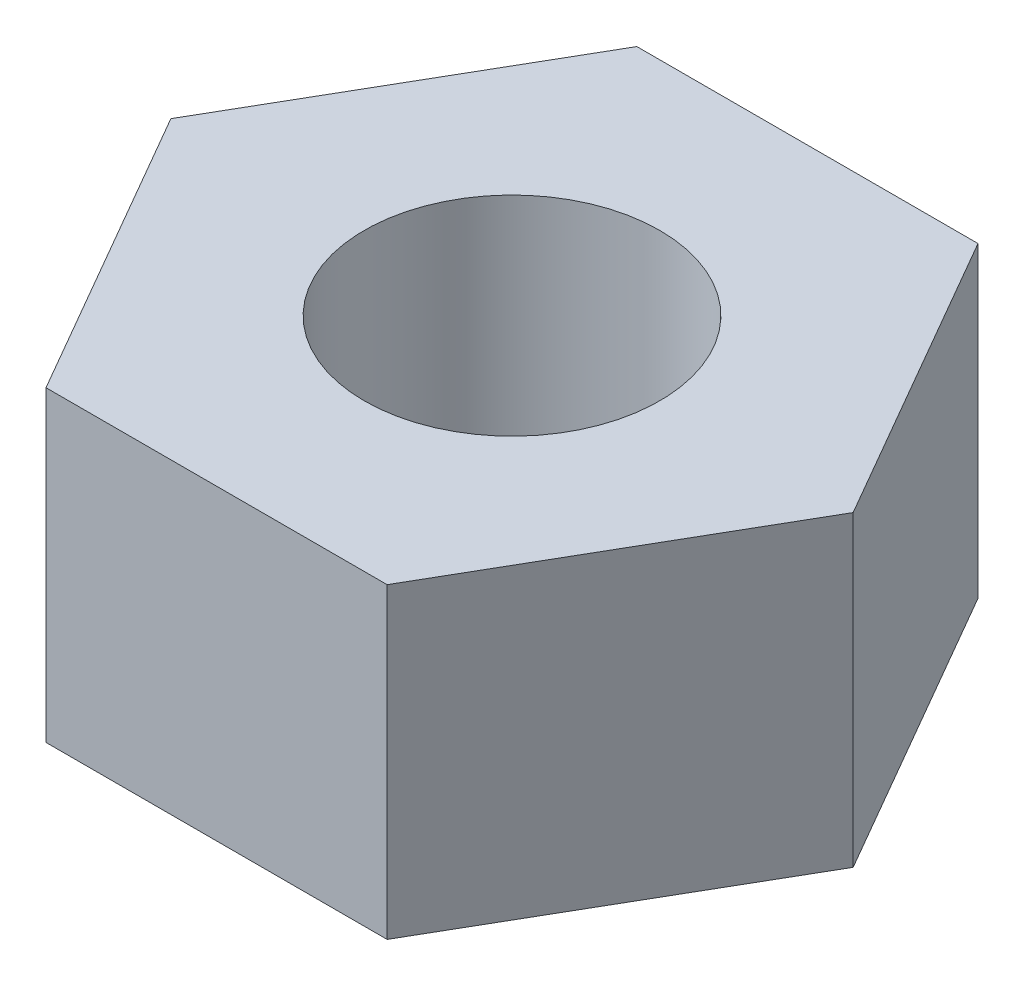
ISO-10303-21;
HEADER;
FILE_DESCRIPTION(('STEP AP214'),'2;1');
FILE_NAME('part.step','',(''),(''),'','','');
FILE_SCHEMA(('AUTOMOTIVE_DESIGN { 1 0 10303 214 1 1 1 1 }'));
ENDSEC;
DATA;
#1=APPLICATION_CONTEXT('core data for automotive mechanical design processes');
#2=APPLICATION_PROTOCOL_DEFINITION('international standard','automotive_design',2000,#1);
#3=PRODUCT_CONTEXT('',#1,'mechanical');
#4=PRODUCT('Part','Part','',(#3));
#5=PRODUCT_RELATED_PRODUCT_CATEGORY('part','',(#4));
#6=PRODUCT_DEFINITION_FORMATION('','',#4);
#7=PRODUCT_DEFINITION_CONTEXT('part definition',#1,'design');
#8=PRODUCT_DEFINITION('design','',#6,#7);
#9=PRODUCT_DEFINITION_SHAPE('','',#8);
#10=(LENGTH_UNIT() NAMED_UNIT(*) SI_UNIT(.MILLI.,.METRE.));
#11=(NAMED_UNIT(*) PLANE_ANGLE_UNIT() SI_UNIT($,.RADIAN.));
#12=(NAMED_UNIT(*) SI_UNIT($,.STERADIAN.) SOLID_ANGLE_UNIT());
#13=UNCERTAINTY_MEASURE_WITH_UNIT(LENGTH_MEASURE(1.E-05),#10,'distance_accuracy_value','');
#14=(GEOMETRIC_REPRESENTATION_CONTEXT(3) GLOBAL_UNCERTAINTY_ASSIGNED_CONTEXT((#13)) GLOBAL_UNIT_ASSIGNED_CONTEXT((#10,
#11,#12)) REPRESENTATION_CONTEXT('',''));
#15=CARTESIAN_POINT('',(0.,0.,0.));
#16=DIRECTION('',(0.,0.,1.));
#17=DIRECTION('',(1.,0.,0.));
#18=AXIS2_PLACEMENT_3D('',#15,#16,#17);
#19=CARTESIAN_POINT('',(0.,5.2,0.));
#20=DIRECTION('',(0.,-1.,0.));
#21=DIRECTION('',(0.,0.,-1.));
#22=AXIS2_PLACEMENT_3D('',#19,#20,#21);
#23=PLANE('',#22);
#24=DIRECTION('',(-1.,0.,0.));
#25=VECTOR('',#24,1.);
#26=CARTESIAN_POINT('',(-2.88675134594813,5.2,-5.));
#27=LINE('',#26,#25);
#28=CARTESIAN_POINT('',(2.88675134594813,5.2,-5.));
#29=VERTEX_POINT('',#28);
#30=CARTESIAN_POINT('',(-2.88675134594813,5.2,-5.));
#31=VERTEX_POINT('',#30);
#32=EDGE_CURVE('E135',#29,#31,#27,.T.);
#33=ORIENTED_EDGE('',*,*,#32,.T.);
#34=DIRECTION('',(-0.500000000000001,0.,0.866025403784438));
#35=VECTOR('',#34,1.);
#36=CARTESIAN_POINT('',(-2.88675134594813,5.2,-5.));
#37=LINE('',#36,#35);
#38=CARTESIAN_POINT('',(-5.77350269189627,5.2,0.));
#39=VERTEX_POINT('',#38);
#40=EDGE_CURVE('E93',#31,#39,#37,.T.);
#41=ORIENTED_EDGE('',*,*,#40,.T.);
#42=DIRECTION('',(0.500000000000001,0.,0.866025403784438));
#43=VECTOR('',#42,1.);
#44=CARTESIAN_POINT('',(-5.77350269189627,5.2,0.));
#45=LINE('',#44,#43);
#46=CARTESIAN_POINT('',(-2.88675134594813,5.2,5.));
#47=VERTEX_POINT('',#46);
#48=EDGE_CURVE('E106',#39,#47,#45,.T.);
#49=ORIENTED_EDGE('',*,*,#48,.T.);
#50=DIRECTION('',(1.,0.,0.));
#51=VECTOR('',#50,1.);
#52=CARTESIAN_POINT('',(-2.88675134594813,5.2,5.));
#53=LINE('',#52,#51);
#54=CARTESIAN_POINT('',(2.88675134594813,5.2,5.));
#55=VERTEX_POINT('',#54);
#56=EDGE_CURVE('E100',#47,#55,#53,.T.);
#57=ORIENTED_EDGE('',*,*,#56,.T.);
#58=DIRECTION('',(0.500000000000001,0.,-0.866025403784438));
#59=VECTOR('',#58,1.);
#60=CARTESIAN_POINT('',(5.77350269189627,5.2,0.));
#61=LINE('',#60,#59);
#62=CARTESIAN_POINT('',(5.77350269189627,5.2,0.));
#63=VERTEX_POINT('',#62);
#64=EDGE_CURVE('E104',#55,#63,#61,.T.);
#65=ORIENTED_EDGE('',*,*,#64,.T.);
#66=DIRECTION('',(-0.500000000000002,0.,-0.866025403784438));
#67=VECTOR('',#66,1.);
#68=CARTESIAN_POINT('',(2.88675134594813,5.2,-5.));
#69=LINE('',#68,#67);
#70=EDGE_CURVE('E56',#63,#29,#69,.T.);
#71=ORIENTED_EDGE('',*,*,#70,.T.);
#72=EDGE_LOOP('',(#33,#41,#49,#57,#65,#71));
#73=FACE_BOUND('',#72,.T.);
#74=CARTESIAN_POINT('',(0.,5.2,0.));
#75=DIRECTION('',(0.,1.,0.));
#76=DIRECTION('',(0.,0.,1.));
#77=AXIS2_PLACEMENT_3D('',#74,#75,#76);
#78=CIRCLE('',#77,2.5);
#79=CARTESIAN_POINT('',(0.,5.2,2.5));
#80=VERTEX_POINT('',#79);
#81=EDGE_CURVE('E128',#80,#80,#78,.T.);
#82=ORIENTED_EDGE('',*,*,#81,.F.);
#83=EDGE_LOOP('',(#82));
#84=FACE_BOUND('',#83,.T.);
#85=ADVANCED_FACE('F39',(#73,#84),#23,.F.);
#86=CARTESIAN_POINT('',(0.,0.,0.));
#87=DIRECTION('',(0.,-1.,0.));
#88=DIRECTION('',(0.,0.,-1.));
#89=AXIS2_PLACEMENT_3D('',#86,#87,#88);
#90=PLANE('',#89);
#91=DIRECTION('',(-1.,0.,0.));
#92=VECTOR('',#91,1.);
#93=CARTESIAN_POINT('',(-2.88675134594813,0.,-5.));
#94=LINE('',#93,#92);
#95=CARTESIAN_POINT('',(2.88675134594813,0.,-5.));
#96=VERTEX_POINT('',#95);
#97=CARTESIAN_POINT('',(-2.88675134594813,0.,-5.));
#98=VERTEX_POINT('',#97);
#99=EDGE_CURVE('E124',#96,#98,#94,.T.);
#100=ORIENTED_EDGE('',*,*,#99,.F.);
#101=DIRECTION('',(-0.500000000000002,0.,-0.866025403784438));
#102=VECTOR('',#101,1.);
#103=CARTESIAN_POINT('',(2.88675134594813,0.,-5.));
#104=LINE('',#103,#102);
#105=CARTESIAN_POINT('',(5.77350269189627,0.,0.));
#106=VERTEX_POINT('',#105);
#107=EDGE_CURVE('E85',#106,#96,#104,.T.);
#108=ORIENTED_EDGE('',*,*,#107,.F.);
#109=DIRECTION('',(0.500000000000001,0.,-0.866025403784438));
#110=VECTOR('',#109,1.);
#111=CARTESIAN_POINT('',(5.77350269189627,0.,0.));
#112=LINE('',#111,#110);
#113=CARTESIAN_POINT('',(2.88675134594813,0.,5.));
#114=VERTEX_POINT('',#113);
#115=EDGE_CURVE('E79',#114,#106,#112,.T.);
#116=ORIENTED_EDGE('',*,*,#115,.F.);
#117=DIRECTION('',(1.,0.,0.));
#118=VECTOR('',#117,1.);
#119=CARTESIAN_POINT('',(-2.88675134594813,0.,5.));
#120=LINE('',#119,#118);
#121=CARTESIAN_POINT('',(-2.88675134594813,0.,5.));
#122=VERTEX_POINT('',#121);
#123=EDGE_CURVE('E114',#122,#114,#120,.T.);
#124=ORIENTED_EDGE('',*,*,#123,.F.);
#125=DIRECTION('',(0.500000000000001,0.,0.866025403784438));
#126=VECTOR('',#125,1.);
#127=CARTESIAN_POINT('',(-5.77350269189627,0.,0.));
#128=LINE('',#127,#126);
#129=CARTESIAN_POINT('',(-5.77350269189627,0.,0.));
#130=VERTEX_POINT('',#129);
#131=EDGE_CURVE('E130',#130,#122,#128,.T.);
#132=ORIENTED_EDGE('',*,*,#131,.F.);
#133=DIRECTION('',(-0.500000000000001,0.,0.866025403784438));
#134=VECTOR('',#133,1.);
#135=CARTESIAN_POINT('',(-2.88675134594813,0.,-5.));
#136=LINE('',#135,#134);
#137=EDGE_CURVE('E127',#98,#130,#136,.T.);
#138=ORIENTED_EDGE('',*,*,#137,.F.);
#139=EDGE_LOOP('',(#100,#108,#116,#124,#132,#138));
#140=FACE_BOUND('',#139,.T.);
#141=CARTESIAN_POINT('',(0.,0.,0.));
#142=DIRECTION('',(0.,1.,0.));
#143=DIRECTION('',(0.,0.,1.));
#144=AXIS2_PLACEMENT_3D('',#141,#142,#143);
#145=CIRCLE('',#144,2.5);
#146=CARTESIAN_POINT('',(0.,0.,2.5));
#147=VERTEX_POINT('',#146);
#148=EDGE_CURVE('E210',#147,#147,#145,.T.);
#149=ORIENTED_EDGE('',*,*,#148,.T.);
#150=EDGE_LOOP('',(#149));
#151=FACE_BOUND('',#150,.T.);
#152=ADVANCED_FACE('F144',(#140,#151),#90,.T.);
#153=CARTESIAN_POINT('',(-2.88675134594813,5.2,-5.));
#154=DIRECTION('',(0.,0.,1.));
#155=DIRECTION('',(1.,0.,0.));
#156=AXIS2_PLACEMENT_3D('',#153,#154,#155);
#157=PLANE('',#156);
#158=ORIENTED_EDGE('',*,*,#99,.T.);
#159=DIRECTION('',(0.,-1.,0.));
#160=VECTOR('',#159,1.);
#161=CARTESIAN_POINT('',(-2.88675134594813,5.2,-5.));
#162=LINE('',#161,#160);
#163=EDGE_CURVE('E11',#31,#98,#162,.T.);
#164=ORIENTED_EDGE('',*,*,#163,.F.);
#165=ORIENTED_EDGE('',*,*,#32,.F.);
#166=DIRECTION('',(0.,-1.,0.));
#167=VECTOR('',#166,1.);
#168=CARTESIAN_POINT('',(2.88675134594813,5.2,-5.));
#169=LINE('',#168,#167);
#170=EDGE_CURVE('E120',#29,#96,#169,.T.);
#171=ORIENTED_EDGE('',*,*,#170,.T.);
#172=EDGE_LOOP('',(#158,#164,#165,#171));
#173=FACE_BOUND('',#172,.T.);
#174=ADVANCED_FACE('F41',(#173),#157,.F.);
#175=CARTESIAN_POINT('',(-2.88675134594813,5.2,-5.));
#176=DIRECTION('',(0.866025403784438,0.,0.500000000000001));
#177=DIRECTION('',(0.500000000000001,0.,-0.866025403784438));
#178=AXIS2_PLACEMENT_3D('',#175,#176,#177);
#179=PLANE('',#178);
#180=ORIENTED_EDGE('',*,*,#137,.T.);
#181=DIRECTION('',(0.,-1.,0.));
#182=VECTOR('',#181,1.);
#183=CARTESIAN_POINT('',(-5.77350269189627,5.2,0.));
#184=LINE('',#183,#182);
#185=EDGE_CURVE('E48',#39,#130,#184,.T.);
#186=ORIENTED_EDGE('',*,*,#185,.F.);
#187=ORIENTED_EDGE('',*,*,#40,.F.);
#188=ORIENTED_EDGE('',*,*,#163,.T.);
#189=EDGE_LOOP('',(#180,#186,#187,#188));
#190=FACE_BOUND('',#189,.T.);
#191=ADVANCED_FACE('F169',(#190),#179,.F.);
#192=CARTESIAN_POINT('',(-5.77350269189627,5.2,0.));
#193=DIRECTION('',(0.866025403784438,0.,-0.500000000000001));
#194=DIRECTION('',(-0.500000000000001,0.,-0.866025403784438));
#195=AXIS2_PLACEMENT_3D('',#192,#193,#194);
#196=PLANE('',#195);
#197=ORIENTED_EDGE('',*,*,#131,.T.);
#198=DIRECTION('',(0.,-1.,0.));
#199=VECTOR('',#198,1.);
#200=CARTESIAN_POINT('',(-2.88675134594813,5.2,5.));
#201=LINE('',#200,#199);
#202=EDGE_CURVE('E115',#47,#122,#201,.T.);
#203=ORIENTED_EDGE('',*,*,#202,.F.);
#204=ORIENTED_EDGE('',*,*,#48,.F.);
#205=ORIENTED_EDGE('',*,*,#185,.T.);
#206=EDGE_LOOP('',(#197,#203,#204,#205));
#207=FACE_BOUND('',#206,.T.);
#208=ADVANCED_FACE('F141',(#207),#196,.F.);
#209=CARTESIAN_POINT('',(-2.88675134594813,5.2,5.));
#210=DIRECTION('',(0.,0.,-1.));
#211=DIRECTION('',(-1.,0.,0.));
#212=AXIS2_PLACEMENT_3D('',#209,#210,#211);
#213=PLANE('',#212);
#214=ORIENTED_EDGE('',*,*,#123,.T.);
#215=DIRECTION('',(0.,-1.,0.));
#216=VECTOR('',#215,1.);
#217=CARTESIAN_POINT('',(2.88675134594813,5.2,5.));
#218=LINE('',#217,#216);
#219=EDGE_CURVE('E111',#55,#114,#218,.T.);
#220=ORIENTED_EDGE('',*,*,#219,.F.);
#221=ORIENTED_EDGE('',*,*,#56,.F.);
#222=ORIENTED_EDGE('',*,*,#202,.T.);
#223=EDGE_LOOP('',(#214,#220,#221,#222));
#224=FACE_BOUND('',#223,.T.);
#225=ADVANCED_FACE('F112',(#224),#213,.F.);
#226=CARTESIAN_POINT('',(5.77350269189627,5.2,0.));
#227=DIRECTION('',(-0.866025403784438,0.,-0.500000000000001));
#228=DIRECTION('',(-0.500000000000001,0.,0.866025403784438));
#229=AXIS2_PLACEMENT_3D('',#226,#227,#228);
#230=PLANE('',#229);
#231=ORIENTED_EDGE('',*,*,#115,.T.);
#232=DIRECTION('',(0.,-1.,0.));
#233=VECTOR('',#232,1.);
#234=CARTESIAN_POINT('',(5.77350269189627,5.2,0.));
#235=LINE('',#234,#233);
#236=EDGE_CURVE('E116',#63,#106,#235,.T.);
#237=ORIENTED_EDGE('',*,*,#236,.F.);
#238=ORIENTED_EDGE('',*,*,#64,.F.);
#239=ORIENTED_EDGE('',*,*,#219,.T.);
#240=EDGE_LOOP('',(#231,#237,#238,#239));
#241=FACE_BOUND('',#240,.T.);
#242=ADVANCED_FACE('F118',(#241),#230,.F.);
#243=CARTESIAN_POINT('',(2.88675134594813,5.2,-5.));
#244=DIRECTION('',(-0.866025403784438,0.,0.500000000000002));
#245=DIRECTION('',(0.500000000000002,0.,0.866025403784438));
#246=AXIS2_PLACEMENT_3D('',#243,#244,#245);
#247=PLANE('',#246);
#248=ORIENTED_EDGE('',*,*,#107,.T.);
#249=ORIENTED_EDGE('',*,*,#170,.F.);
#250=ORIENTED_EDGE('',*,*,#70,.F.);
#251=ORIENTED_EDGE('',*,*,#236,.T.);
#252=EDGE_LOOP('',(#248,#249,#250,#251));
#253=FACE_BOUND('',#252,.T.);
#254=ADVANCED_FACE('F149',(#253),#247,.F.);
#255=CARTESIAN_POINT('',(0.,5.2,0.));
#256=DIRECTION('',(0.,-1.,0.));
#257=DIRECTION('',(0.,0.,-1.));
#258=AXIS2_PLACEMENT_3D('',#255,#256,#257);
#259=CYLINDRICAL_SURFACE('',#258,2.5);
#260=ORIENTED_EDGE('',*,*,#81,.T.);
#261=EDGE_LOOP('',(#260));
#262=FACE_BOUND('',#261,.T.);
#263=ORIENTED_EDGE('',*,*,#148,.F.);
#264=EDGE_LOOP('',(#263));
#265=FACE_BOUND('',#264,.T.);
#266=ADVANCED_FACE('F151',(#262,#265),#259,.F.);
#267=CLOSED_SHELL('',(#85,#152,#174,#191,#208,#225,#242,#254,#266));
#268=MANIFOLD_SOLID_BREP('B2',#267);
#269=ADVANCED_BREP_SHAPE_REPRESENTATION('',(#18,#268),#14);
#270=SHAPE_DEFINITION_REPRESENTATION(#9,#269);
ENDSEC;
END-ISO-10303-21;
